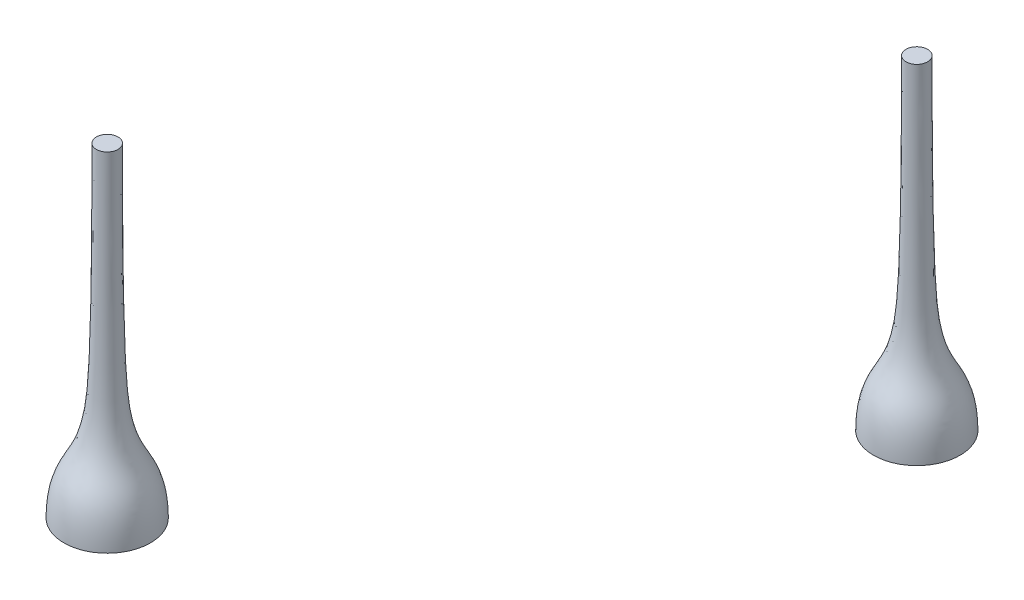
ISO-10303-21;
HEADER;
FILE_DESCRIPTION(('STEP AP214'),'2;1');
FILE_NAME('part.step','',(''),(''),'','','');
FILE_SCHEMA(('AUTOMOTIVE_DESIGN { 1 0 10303 214 1 1 1 1 }'));
ENDSEC;
DATA;
#1=APPLICATION_CONTEXT('core data for automotive mechanical design processes');
#2=APPLICATION_PROTOCOL_DEFINITION('international standard','automotive_design',2000,#1);
#3=PRODUCT_CONTEXT('',#1,'mechanical');
#4=PRODUCT('Part','Part','',(#3));
#5=PRODUCT_RELATED_PRODUCT_CATEGORY('part','',(#4));
#6=PRODUCT_DEFINITION_FORMATION('','',#4);
#7=PRODUCT_DEFINITION_CONTEXT('part definition',#1,'design');
#8=PRODUCT_DEFINITION('design','',#6,#7);
#9=PRODUCT_DEFINITION_SHAPE('','',#8);
#10=(LENGTH_UNIT() NAMED_UNIT(*) SI_UNIT(.MILLI.,.METRE.));
#11=(NAMED_UNIT(*) PLANE_ANGLE_UNIT() SI_UNIT($,.RADIAN.));
#12=(NAMED_UNIT(*) SI_UNIT($,.STERADIAN.) SOLID_ANGLE_UNIT());
#13=UNCERTAINTY_MEASURE_WITH_UNIT(LENGTH_MEASURE(1.E-05),#10,'distance_accuracy_value','');
#14=(GEOMETRIC_REPRESENTATION_CONTEXT(3) GLOBAL_UNCERTAINTY_ASSIGNED_CONTEXT((#13)) GLOBAL_UNIT_ASSIGNED_CONTEXT((#10,
#11,#12)) REPRESENTATION_CONTEXT('',''));
#15=CARTESIAN_POINT('',(0.,0.,0.));
#16=DIRECTION('',(0.,0.,1.));
#17=DIRECTION('',(1.,0.,0.));
#18=AXIS2_PLACEMENT_3D('',#15,#16,#17);
#19=CARTESIAN_POINT('',(-16.1505406664726,14.0507640836842,21.2651827288615));
#20=DIRECTION('',(0.,-1.,0.));
#21=DIRECTION('',(-0.180500513067623,0.,-0.983574890276447));
#22=AXIS2_PLACEMENT_3D('',#19,#20,#21);
#23=PLANE('',#22);
#24=CARTESIAN_POINT('',(-16.1505406664726,14.0507640836842,21.2651827288615));
#25=DIRECTION('',(0.,1.,0.));
#26=DIRECTION('',(0.180500513067623,0.,0.983574890276447));
#27=AXIS2_PLACEMENT_3D('',#24,#25,#26);
#28=CIRCLE('',#27,0.5);
#29=CARTESIAN_POINT('',(-16.0602904099387,14.0507640836842,21.7569701739998));
#30=VERTEX_POINT('',#29);
#31=EDGE_CURVE('E11',#30,#30,#28,.T.);
#32=ORIENTED_EDGE('',*,*,#31,.T.);
#33=EDGE_LOOP('',(#32));
#34=FACE_BOUND('',#33,.T.);
#35=ADVANCED_FACE('F40',(#34),#23,.F.);
#36=CARTESIAN_POINT('',(-14.1833908859197,-0.949235916315778,20.9041817027263));
#37=CARTESIAN_POINT('',(-14.2129470338802,1.40221728062663,20.90960569222));
#38=CARTESIAN_POINT('',(-15.224034617541,1.08432019382162,21.0951551906988));
#39=CARTESIAN_POINT('',(-15.5885203677696,5.04569010253377,21.1620437068377));
#40=CARTESIAN_POINT('',(-15.6571131035339,8.71155608075896,21.174631486498));
#41=CARTESIAN_POINT('',(-15.6587532213343,14.0507640836842,21.1749324723277));
#42=B_SPLINE_CURVE_WITH_KNOTS('',3,(#36,#37,#38,#39,#40,#41),.UNSPECIFIED.,.F.,.F.,(4,1,1,4),
(0.,0.669768410961681,0.769768410961681,1.),.UNSPECIFIED.);
#43=CARTESIAN_POINT('',(-16.1505406664726,14.0507640836842,21.2651827288615));
#44=DIRECTION('',(0.,1.,0.));
#45=AXIS1_PLACEMENT('',#43,#44);
#46=SURFACE_OF_REVOLUTION('',#42,#45);
#47=ORIENTED_EDGE('',*,*,#31,.F.);
#48=EDGE_LOOP('',(#47));
#49=FACE_BOUND('',#48,.T.);
#50=CARTESIAN_POINT('',(-16.1505406664726,-0.949235916315775,21.2651827288615));
#51=DIRECTION('',(0.,1.,0.));
#52=DIRECTION('',(0.180500513067623,0.,0.983574890276447));
#53=AXIS2_PLACEMENT_3D('',#50,#51,#52);
#54=CIRCLE('',#53,2.);
#55=CARTESIAN_POINT('',(-15.7895396403373,-0.949235916315775,23.2323325094144));
#56=VERTEX_POINT('',#55);
#57=EDGE_CURVE('E46',#56,#56,#54,.T.);
#58=ORIENTED_EDGE('',*,*,#57,.T.);
#59=EDGE_LOOP('',(#58));
#60=FACE_BOUND('',#59,.T.);
#61=ADVANCED_FACE('F59',(#49,#60),#46,.T.);
#62=CARTESIAN_POINT('',(-16.1505406664726,-0.949235916315775,21.2651827288615));
#63=DIRECTION('',(0.,1.,0.));
#64=DIRECTION('',(0.180500513067623,0.,0.983574890276447));
#65=AXIS2_PLACEMENT_3D('',#62,#63,#64);
#66=PLANE('',#65);
#67=ORIENTED_EDGE('',*,*,#57,.F.);
#68=EDGE_LOOP('',(#67));
#69=FACE_BOUND('',#68,.T.);
#70=ADVANCED_FACE('F62',(#69),#66,.F.);
#71=CLOSED_SHELL('',(#35,#61,#70));
#72=MANIFOLD_SOLID_BREP('B2',#71);
#73=CARTESIAN_POINT('',(0.,15.,0.));
#74=DIRECTION('',(0.,-1.,0.));
#75=DIRECTION('',(0.,0.,-1.));
#76=AXIS2_PLACEMENT_3D('',#73,#74,#75);
#77=PLANE('',#76);
#78=CARTESIAN_POINT('',(0.,15.,0.));
#79=DIRECTION('',(0.,1.,0.));
#80=DIRECTION('',(0.,0.,1.));
#81=AXIS2_PLACEMENT_3D('',#78,#79,#80);
#82=CIRCLE('',#81,0.5);
#83=CARTESIAN_POINT('',(0.,15.,0.5));
#84=VERTEX_POINT('',#83);
#85=EDGE_CURVE('E39',#84,#84,#82,.T.);
#86=ORIENTED_EDGE('',*,*,#85,.T.);
#87=EDGE_LOOP('',(#86));
#88=FACE_BOUND('',#87,.T.);
#89=ADVANCED_FACE('F88',(#88),#77,.F.);
#90=CARTESIAN_POINT('',(2.,0.,0.));
#91=CARTESIAN_POINT('',(1.96995028212624,2.3514531969424,0.));
#92=CARTESIAN_POINT('',(0.941978143292364,2.03355611013739,0.));
#93=CARTESIAN_POINT('',(0.571405700022448,5.99492601884955,0.));
#94=CARTESIAN_POINT('',(0.501667506782302,9.66079199707474,0.));
#95=CARTESIAN_POINT('',(0.5,15.,0.));
#96=B_SPLINE_CURVE_WITH_KNOTS('',3,(#90,#91,#92,#93,#94,#95),.UNSPECIFIED.,.F.,.F.,(4,1,1,4),
(0.,0.669768410961681,0.769768410961681,1.),.UNSPECIFIED.);
#97=CARTESIAN_POINT('',(0.,15.,0.));
#98=DIRECTION('',(0.,1.,0.));
#99=AXIS1_PLACEMENT('',#97,#98);
#100=SURFACE_OF_REVOLUTION('',#96,#99);
#101=ORIENTED_EDGE('',*,*,#85,.F.);
#102=EDGE_LOOP('',(#101));
#103=FACE_BOUND('',#102,.T.);
#104=CARTESIAN_POINT('',(0.,0.,0.));
#105=DIRECTION('',(0.,1.,0.));
#106=DIRECTION('',(0.,0.,1.));
#107=AXIS2_PLACEMENT_3D('',#104,#105,#106);
#108=CIRCLE('',#107,2.);
#109=CARTESIAN_POINT('',(0.,0.,2.));
#110=VERTEX_POINT('',#109);
#111=EDGE_CURVE('E94',#110,#110,#108,.T.);
#112=ORIENTED_EDGE('',*,*,#111,.T.);
#113=EDGE_LOOP('',(#112));
#114=FACE_BOUND('',#113,.T.);
#115=ADVANCED_FACE('F107',(#103,#114),#100,.T.);
#116=CARTESIAN_POINT('',(0.,0.,0.));
#117=DIRECTION('',(0.,1.,0.));
#118=DIRECTION('',(0.,0.,1.));
#119=AXIS2_PLACEMENT_3D('',#116,#117,#118);
#120=PLANE('',#119);
#121=ORIENTED_EDGE('',*,*,#111,.F.);
#122=EDGE_LOOP('',(#121));
#123=FACE_BOUND('',#122,.T.);
#124=ADVANCED_FACE('F110',(#123),#120,.F.);
#125=CLOSED_SHELL('',(#89,#115,#124));
#126=MANIFOLD_SOLID_BREP('B6',#125);
#127=ADVANCED_BREP_SHAPE_REPRESENTATION('',(#18,#72,#126),#14);
#128=SHAPE_DEFINITION_REPRESENTATION(#9,#127);
ENDSEC;
END-ISO-10303-21;
